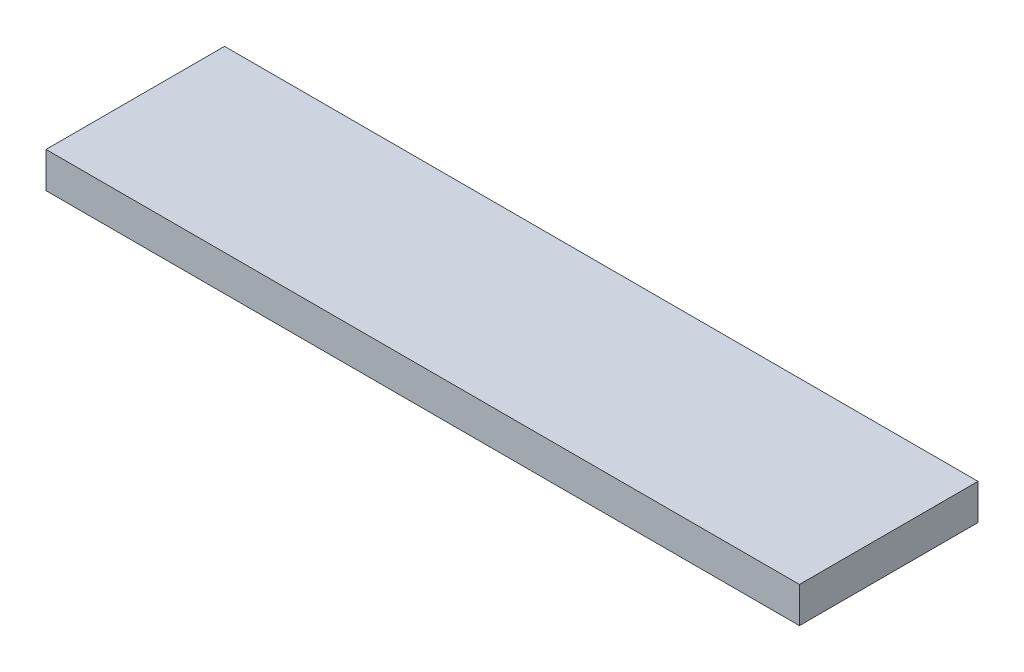
ISO-10303-21;
HEADER;
FILE_DESCRIPTION(('STEP AP214'),'2;1');
FILE_NAME('part.step','',(''),(''),'','','');
FILE_SCHEMA(('AUTOMOTIVE_DESIGN { 1 0 10303 214 1 1 1 1 }'));
ENDSEC;
DATA;
#1=APPLICATION_CONTEXT('core data for automotive mechanical design processes');
#2=APPLICATION_PROTOCOL_DEFINITION('international standard','automotive_design',2000,#1);
#3=PRODUCT_CONTEXT('',#1,'mechanical');
#4=PRODUCT('Part','Part','',(#3));
#5=PRODUCT_RELATED_PRODUCT_CATEGORY('part','',(#4));
#6=PRODUCT_DEFINITION_FORMATION('','',#4);
#7=PRODUCT_DEFINITION_CONTEXT('part definition',#1,'design');
#8=PRODUCT_DEFINITION('design','',#6,#7);
#9=PRODUCT_DEFINITION_SHAPE('','',#8);
#10=(LENGTH_UNIT() NAMED_UNIT(*) SI_UNIT(.MILLI.,.METRE.));
#11=(NAMED_UNIT(*) PLANE_ANGLE_UNIT() SI_UNIT($,.RADIAN.));
#12=(NAMED_UNIT(*) SI_UNIT($,.STERADIAN.) SOLID_ANGLE_UNIT());
#13=UNCERTAINTY_MEASURE_WITH_UNIT(LENGTH_MEASURE(1.E-05),#10,'distance_accuracy_value','');
#14=(GEOMETRIC_REPRESENTATION_CONTEXT(3) GLOBAL_UNCERTAINTY_ASSIGNED_CONTEXT((#13)) GLOBAL_UNIT_ASSIGNED_CONTEXT((#10,
#11,#12)) REPRESENTATION_CONTEXT('',''));
#15=CARTESIAN_POINT('',(0.,0.,0.));
#16=DIRECTION('',(0.,0.,1.));
#17=DIRECTION('',(1.,0.,0.));
#18=AXIS2_PLACEMENT_3D('',#15,#16,#17);
#19=CARTESIAN_POINT('',(31.65,3.,7.5));
#20=DIRECTION('',(-1.,0.,0.));
#21=DIRECTION('',(0.,0.,1.));
#22=AXIS2_PLACEMENT_3D('',#19,#20,#21);
#23=PLANE('',#22);
#24=DIRECTION('',(0.,0.,-1.));
#25=VECTOR('',#24,1.);
#26=CARTESIAN_POINT('',(31.65,0.,7.5));
#27=LINE('',#26,#25);
#28=CARTESIAN_POINT('',(31.65,0.,7.5));
#29=VERTEX_POINT('',#28);
#30=CARTESIAN_POINT('',(31.65,0.,-7.5));
#31=VERTEX_POINT('',#30);
#32=EDGE_CURVE('E107',#29,#31,#27,.T.);
#33=ORIENTED_EDGE('',*,*,#32,.T.);
#34=DIRECTION('',(0.,-1.,0.));
#35=VECTOR('',#34,1.);
#36=CARTESIAN_POINT('',(31.65,3.,-7.5));
#37=LINE('',#36,#35);
#38=CARTESIAN_POINT('',(31.65,3.,-7.5));
#39=VERTEX_POINT('',#38);
#40=EDGE_CURVE('E11',#39,#31,#37,.T.);
#41=ORIENTED_EDGE('',*,*,#40,.F.);
#42=DIRECTION('',(0.,0.,-1.));
#43=VECTOR('',#42,1.);
#44=CARTESIAN_POINT('',(31.65,3.,7.5));
#45=LINE('',#44,#43);
#46=CARTESIAN_POINT('',(31.65,3.,7.5));
#47=VERTEX_POINT('',#46);
#48=EDGE_CURVE('E91',#47,#39,#45,.T.);
#49=ORIENTED_EDGE('',*,*,#48,.F.);
#50=DIRECTION('',(0.,-1.,0.));
#51=VECTOR('',#50,1.);
#52=CARTESIAN_POINT('',(31.65,3.,7.5));
#53=LINE('',#52,#51);
#54=EDGE_CURVE('E103',#47,#29,#53,.T.);
#55=ORIENTED_EDGE('',*,*,#54,.T.);
#56=EDGE_LOOP('',(#33,#41,#49,#55));
#57=FACE_BOUND('',#56,.T.);
#58=ADVANCED_FACE('F39',(#57),#23,.F.);
#59=CARTESIAN_POINT('',(-31.65,3.,-7.5));
#60=DIRECTION('',(0.,0.,1.));
#61=DIRECTION('',(1.,0.,0.));
#62=AXIS2_PLACEMENT_3D('',#59,#60,#61);
#63=PLANE('',#62);
#64=DIRECTION('',(-1.,0.,0.));
#65=VECTOR('',#64,1.);
#66=CARTESIAN_POINT('',(-31.65,0.,-7.5));
#67=LINE('',#66,#65);
#68=CARTESIAN_POINT('',(-31.65,0.,-7.5));
#69=VERTEX_POINT('',#68);
#70=EDGE_CURVE('E96',#31,#69,#67,.T.);
#71=ORIENTED_EDGE('',*,*,#70,.T.);
#72=DIRECTION('',(0.,-1.,0.));
#73=VECTOR('',#72,1.);
#74=CARTESIAN_POINT('',(-31.65,3.,-7.5));
#75=LINE('',#74,#73);
#76=CARTESIAN_POINT('',(-31.65,3.,-7.5));
#77=VERTEX_POINT('',#76);
#78=EDGE_CURVE('E48',#77,#69,#75,.T.);
#79=ORIENTED_EDGE('',*,*,#78,.F.);
#80=DIRECTION('',(-1.,0.,0.));
#81=VECTOR('',#80,1.);
#82=CARTESIAN_POINT('',(-31.65,3.,-7.5));
#83=LINE('',#82,#81);
#84=EDGE_CURVE('E86',#39,#77,#83,.T.);
#85=ORIENTED_EDGE('',*,*,#84,.F.);
#86=ORIENTED_EDGE('',*,*,#40,.T.);
#87=EDGE_LOOP('',(#71,#79,#85,#86));
#88=FACE_BOUND('',#87,.T.);
#89=ADVANCED_FACE('F95',(#88),#63,.F.);
#90=CARTESIAN_POINT('',(-31.65,3.,7.5));
#91=DIRECTION('',(1.,0.,0.));
#92=DIRECTION('',(0.,0.,-1.));
#93=AXIS2_PLACEMENT_3D('',#90,#91,#92);
#94=PLANE('',#93);
#95=DIRECTION('',(0.,0.,1.));
#96=VECTOR('',#95,1.);
#97=CARTESIAN_POINT('',(-31.65,0.,7.5));
#98=LINE('',#97,#96);
#99=CARTESIAN_POINT('',(-31.65,0.,7.5));
#100=VERTEX_POINT('',#99);
#101=EDGE_CURVE('E73',#69,#100,#98,.T.);
#102=ORIENTED_EDGE('',*,*,#101,.T.);
#103=DIRECTION('',(0.,-1.,0.));
#104=VECTOR('',#103,1.);
#105=CARTESIAN_POINT('',(-31.65,3.,7.5));
#106=LINE('',#105,#104);
#107=CARTESIAN_POINT('',(-31.65,3.,7.5));
#108=VERTEX_POINT('',#107);
#109=EDGE_CURVE('E98',#108,#100,#106,.T.);
#110=ORIENTED_EDGE('',*,*,#109,.F.);
#111=DIRECTION('',(0.,0.,1.));
#112=VECTOR('',#111,1.);
#113=CARTESIAN_POINT('',(-31.65,3.,7.5));
#114=LINE('',#113,#112);
#115=EDGE_CURVE('E89',#77,#108,#114,.T.);
#116=ORIENTED_EDGE('',*,*,#115,.F.);
#117=ORIENTED_EDGE('',*,*,#78,.T.);
#118=EDGE_LOOP('',(#102,#110,#116,#117));
#119=FACE_BOUND('',#118,.T.);
#120=ADVANCED_FACE('F99',(#119),#94,.F.);
#121=CARTESIAN_POINT('',(-31.65,3.,7.5));
#122=DIRECTION('',(0.,0.,-1.));
#123=DIRECTION('',(-1.,0.,0.));
#124=AXIS2_PLACEMENT_3D('',#121,#122,#123);
#125=PLANE('',#124);
#126=DIRECTION('',(1.,0.,0.));
#127=VECTOR('',#126,1.);
#128=CARTESIAN_POINT('',(-31.65,0.,7.5));
#129=LINE('',#128,#127);
#130=EDGE_CURVE('E79',#100,#29,#129,.T.);
#131=ORIENTED_EDGE('',*,*,#130,.T.);
#132=ORIENTED_EDGE('',*,*,#54,.F.);
#133=DIRECTION('',(1.,0.,0.));
#134=VECTOR('',#133,1.);
#135=CARTESIAN_POINT('',(-31.65,3.,7.5));
#136=LINE('',#135,#134);
#137=EDGE_CURVE('E56',#108,#47,#136,.T.);
#138=ORIENTED_EDGE('',*,*,#137,.F.);
#139=ORIENTED_EDGE('',*,*,#109,.T.);
#140=EDGE_LOOP('',(#131,#132,#138,#139));
#141=FACE_BOUND('',#140,.T.);
#142=ADVANCED_FACE('F120',(#141),#125,.F.);
#143=CARTESIAN_POINT('',(0.,3.,0.));
#144=DIRECTION('',(0.,-1.,0.));
#145=DIRECTION('',(0.,0.,-1.));
#146=AXIS2_PLACEMENT_3D('',#143,#144,#145);
#147=PLANE('',#146);
#148=ORIENTED_EDGE('',*,*,#48,.T.);
#149=ORIENTED_EDGE('',*,*,#84,.T.);
#150=ORIENTED_EDGE('',*,*,#115,.T.);
#151=ORIENTED_EDGE('',*,*,#137,.T.);
#152=EDGE_LOOP('',(#148,#149,#150,#151));
#153=FACE_BOUND('',#152,.T.);
#154=ADVANCED_FACE('F87',(#153),#147,.F.);
#155=CARTESIAN_POINT('',(0.,0.,0.));
#156=DIRECTION('',(0.,-1.,0.));
#157=DIRECTION('',(0.,0.,-1.));
#158=AXIS2_PLACEMENT_3D('',#155,#156,#157);
#159=PLANE('',#158);
#160=ORIENTED_EDGE('',*,*,#32,.F.);
#161=ORIENTED_EDGE('',*,*,#130,.F.);
#162=ORIENTED_EDGE('',*,*,#101,.F.);
#163=ORIENTED_EDGE('',*,*,#70,.F.);
#164=EDGE_LOOP('',(#160,#161,#162,#163));
#165=FACE_BOUND('',#164,.T.);
#166=ADVANCED_FACE('F123',(#165),#159,.T.);
#167=CLOSED_SHELL('',(#58,#89,#120,#142,#154,#166));
#168=MANIFOLD_SOLID_BREP('B2',#167);
#169=ADVANCED_BREP_SHAPE_REPRESENTATION('',(#18,#168),#14);
#170=SHAPE_DEFINITION_REPRESENTATION(#9,#169);
ENDSEC;
END-ISO-10303-21;
